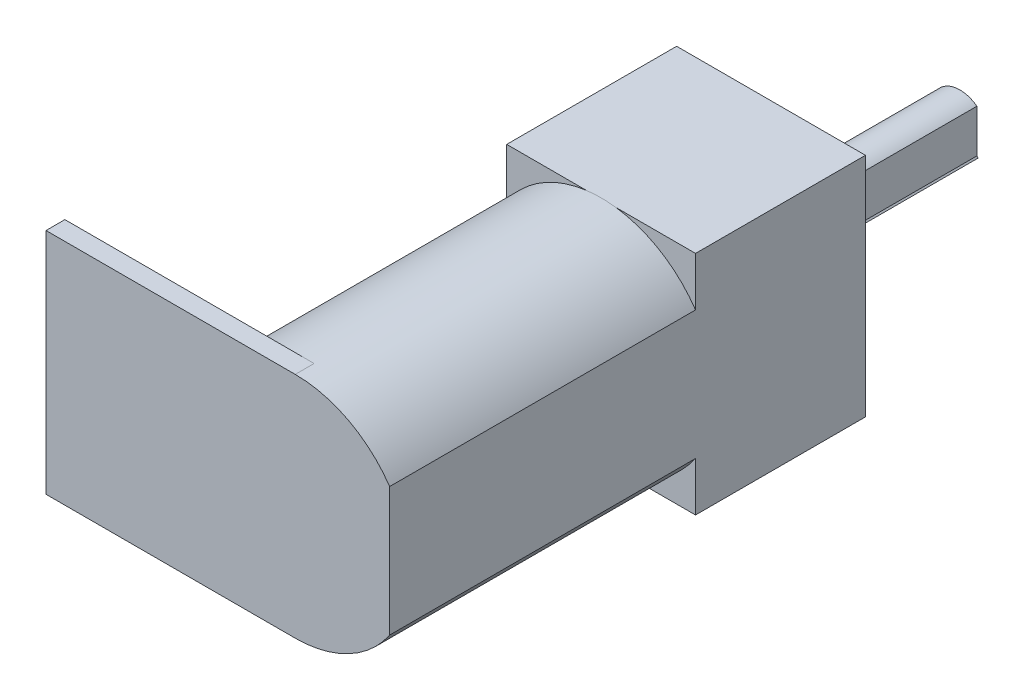
ISO-10303-21;
HEADER;
FILE_DESCRIPTION(('STEP AP214'),'2;1');
FILE_NAME('part.step','',(''),(''),'','','');
FILE_SCHEMA(('AUTOMOTIVE_DESIGN { 1 0 10303 214 1 1 1 1 }'));
ENDSEC;
DATA;
#1=APPLICATION_CONTEXT('core data for automotive mechanical design processes');
#2=APPLICATION_PROTOCOL_DEFINITION('international standard','automotive_design',2000,#1);
#3=PRODUCT_CONTEXT('',#1,'mechanical');
#4=PRODUCT('Part','Part','',(#3));
#5=PRODUCT_RELATED_PRODUCT_CATEGORY('part','',(#4));
#6=PRODUCT_DEFINITION_FORMATION('','',#4);
#7=PRODUCT_DEFINITION_CONTEXT('part definition',#1,'design');
#8=PRODUCT_DEFINITION('design','',#6,#7);
#9=PRODUCT_DEFINITION_SHAPE('','',#8);
#10=(LENGTH_UNIT() NAMED_UNIT(*) SI_UNIT(.MILLI.,.METRE.));
#11=(NAMED_UNIT(*) PLANE_ANGLE_UNIT() SI_UNIT($,.RADIAN.));
#12=(NAMED_UNIT(*) SI_UNIT($,.STERADIAN.) SOLID_ANGLE_UNIT());
#13=UNCERTAINTY_MEASURE_WITH_UNIT(LENGTH_MEASURE(1.E-05),#10,'distance_accuracy_value','');
#14=(GEOMETRIC_REPRESENTATION_CONTEXT(3) GLOBAL_UNCERTAINTY_ASSIGNED_CONTEXT((#13)) GLOBAL_UNIT_ASSIGNED_CONTEXT((#10,
#11,#12)) REPRESENTATION_CONTEXT('',''));
#15=CARTESIAN_POINT('',(0.,0.,0.));
#16=DIRECTION('',(0.,0.,1.));
#17=DIRECTION('',(1.,0.,0.));
#18=AXIS2_PLACEMENT_3D('',#15,#16,#17);
#19=CARTESIAN_POINT('',(0.,0.,0.));
#20=DIRECTION('',(0.,0.,1.));
#21=DIRECTION('',(1.,0.,0.));
#22=AXIS2_PLACEMENT_3D('',#19,#20,#21);
#23=PLANE('',#22);
#24=DIRECTION('',(-1.,0.,0.));
#25=VECTOR('',#24,1.);
#26=CARTESIAN_POINT('',(5.,-6.,0.));
#27=LINE('',#26,#25);
#28=CARTESIAN_POINT('',(0.776208734813005,-6.,0.));
#29=VERTEX_POINT('',#28);
#30=CARTESIAN_POINT('',(-0.776208734813006,-6.,0.));
#31=VERTEX_POINT('',#30);
#32=EDGE_CURVE('E9',#29,#31,#27,.T.);
#33=ORIENTED_EDGE('',*,*,#32,.F.);
#34=CARTESIAN_POINT('',(0.,0.,0.));
#35=DIRECTION('',(0.,0.,1.));
#36=DIRECTION('',(1.,0.,0.));
#37=AXIS2_PLACEMENT_3D('',#34,#35,#36);
#38=CIRCLE('',#37,6.05);
#39=EDGE_CURVE('E313',#31,#29,#38,.T.);
#40=ORIENTED_EDGE('',*,*,#39,.F.);
#41=EDGE_LOOP('',(#33,#40));
#42=FACE_BOUND('',#41,.T.);
#43=ADVANCED_FACE('F15',(#42),#23,.F.);
#44=DIRECTION('',(1.,0.,0.));
#45=VECTOR('',#44,1.);
#46=CARTESIAN_POINT('',(-5.,6.,0.));
#47=LINE('',#46,#45);
#48=CARTESIAN_POINT('',(-0.776208734813017,6.,0.));
#49=VERTEX_POINT('',#48);
#50=CARTESIAN_POINT('',(0.776208734813021,6.,0.));
#51=VERTEX_POINT('',#50);
#52=EDGE_CURVE('E25',#49,#51,#47,.T.);
#53=ORIENTED_EDGE('',*,*,#52,.F.);
#54=CARTESIAN_POINT('',(0.,0.,0.));
#55=DIRECTION('',(0.,0.,1.));
#56=DIRECTION('',(1.,0.,0.));
#57=AXIS2_PLACEMENT_3D('',#54,#55,#56);
#58=CIRCLE('',#57,6.05);
#59=EDGE_CURVE('E296',#51,#49,#58,.T.);
#60=ORIENTED_EDGE('',*,*,#59,.F.);
#61=EDGE_LOOP('',(#53,#60));
#62=FACE_BOUND('',#61,.T.);
#63=ADVANCED_FACE('F349',(#62),#23,.F.);
#64=CARTESIAN_POINT('',(0.,0.,15.2));
#65=DIRECTION('',(0.,0.,-1.));
#66=DIRECTION('',(-1.,0.,0.));
#67=AXIS2_PLACEMENT_3D('',#64,#65,#66);
#68=CYLINDRICAL_SURFACE('',#67,6.05);
#69=CARTESIAN_POINT('',(-5.,-3.40624426605023,0.));
#70=VERTEX_POINT('',#69);
#71=EDGE_CURVE('E19',#70,#31,#38,.T.);
#72=ORIENTED_EDGE('',*,*,#71,.T.);
#73=ORIENTED_EDGE('',*,*,#39,.T.);
#74=CARTESIAN_POINT('',(5.,-3.40624426605022,0.));
#75=VERTEX_POINT('',#74);
#76=EDGE_CURVE('E306',#29,#75,#38,.T.);
#77=ORIENTED_EDGE('',*,*,#76,.T.);
#78=DIRECTION('',(0.,0.,-1.));
#79=VECTOR('',#78,1.);
#80=CARTESIAN_POINT('',(5.,-3.40624426605022,15.2));
#81=LINE('',#80,#79);
#82=CARTESIAN_POINT('',(5.,-3.40624426605022,16.2));
#83=VERTEX_POINT('',#82);
#84=EDGE_CURVE('E303',#83,#75,#81,.T.);
#85=ORIENTED_EDGE('',*,*,#84,.F.);
#86=CARTESIAN_POINT('',(0.,0.,16.2));
#87=DIRECTION('',(0.,0.,1.));
#88=DIRECTION('',(1.,0.,0.));
#89=AXIS2_PLACEMENT_3D('',#86,#87,#88);
#90=CIRCLE('',#89,6.05);
#91=CARTESIAN_POINT('',(0.,-6.05,16.2));
#92=VERTEX_POINT('',#91);
#93=EDGE_CURVE('E175',#92,#83,#90,.T.);
#94=ORIENTED_EDGE('',*,*,#93,.F.);
#95=DIRECTION('',(0.,0.,-1.));
#96=VECTOR('',#95,1.);
#97=CARTESIAN_POINT('',(0.,-6.05,16.2));
#98=LINE('',#97,#96);
#99=CARTESIAN_POINT('',(0.,-6.05,15.2));
#100=VERTEX_POINT('',#99);
#101=EDGE_CURVE('E195',#92,#100,#98,.T.);
#102=ORIENTED_EDGE('',*,*,#101,.T.);
#103=CARTESIAN_POINT('',(0.,0.,15.2));
#104=DIRECTION('',(0.,0.,1.));
#105=DIRECTION('',(1.,0.,0.));
#106=AXIS2_PLACEMENT_3D('',#103,#104,#105);
#107=CIRCLE('',#106,6.05);
#108=CARTESIAN_POINT('',(-5.,-3.40624426605023,15.2));
#109=VERTEX_POINT('',#108);
#110=EDGE_CURVE('E43',#109,#100,#107,.T.);
#111=ORIENTED_EDGE('',*,*,#110,.F.);
#112=DIRECTION('',(0.,0.,-1.));
#113=VECTOR('',#112,1.);
#114=CARTESIAN_POINT('',(-5.,-3.40624426605023,15.2));
#115=LINE('',#114,#113);
#116=EDGE_CURVE('E299',#109,#70,#115,.T.);
#117=ORIENTED_EDGE('',*,*,#116,.T.);
#118=EDGE_LOOP('',(#72,#73,#77,#85,#94,#102,#111,#117));
#119=FACE_BOUND('',#118,.T.);
#120=ADVANCED_FACE('F17',(#119),#68,.T.);
#121=CARTESIAN_POINT('',(5.,-3.40624426605022,15.2));
#122=DIRECTION('',(-1.,0.,0.));
#123=DIRECTION('',(0.,0.,1.));
#124=AXIS2_PLACEMENT_3D('',#121,#122,#123);
#125=PLANE('',#124);
#126=ORIENTED_EDGE('',*,*,#84,.T.);
#127=DIRECTION('',(0.,-1.,0.));
#128=VECTOR('',#127,1.);
#129=CARTESIAN_POINT('',(5.,6.,0.));
#130=LINE('',#129,#128);
#131=CARTESIAN_POINT('',(5.,-6.,0.));
#132=VERTEX_POINT('',#131);
#133=EDGE_CURVE('E260',#75,#132,#130,.T.);
#134=ORIENTED_EDGE('',*,*,#133,.T.);
#135=DIRECTION('',(0.,0.,1.));
#136=VECTOR('',#135,1.);
#137=CARTESIAN_POINT('',(5.,-6.,-9.));
#138=LINE('',#137,#136);
#139=CARTESIAN_POINT('',(5.,-6.,-9.));
#140=VERTEX_POINT('',#139);
#141=EDGE_CURVE('E267',#140,#132,#138,.T.);
#142=ORIENTED_EDGE('',*,*,#141,.F.);
#143=DIRECTION('',(0.,-1.,0.));
#144=VECTOR('',#143,1.);
#145=CARTESIAN_POINT('',(5.,6.,-9.));
#146=LINE('',#145,#144);
#147=CARTESIAN_POINT('',(5.,6.,-9.));
#148=VERTEX_POINT('',#147);
#149=EDGE_CURVE('E244',#148,#140,#146,.T.);
#150=ORIENTED_EDGE('',*,*,#149,.F.);
#151=DIRECTION('',(0.,0.,1.));
#152=VECTOR('',#151,1.);
#153=CARTESIAN_POINT('',(5.,6.,-9.));
#154=LINE('',#153,#152);
#155=CARTESIAN_POINT('',(5.,6.,0.));
#156=VERTEX_POINT('',#155);
#157=EDGE_CURVE('E271',#148,#156,#154,.T.);
#158=ORIENTED_EDGE('',*,*,#157,.T.);
#159=CARTESIAN_POINT('',(5.,3.40624426605022,0.));
#160=VERTEX_POINT('',#159);
#161=EDGE_CURVE('E261',#156,#160,#130,.T.);
#162=ORIENTED_EDGE('',*,*,#161,.T.);
#163=DIRECTION('',(0.,0.,-1.));
#164=VECTOR('',#163,1.);
#165=CARTESIAN_POINT('',(5.,3.40624426605022,15.2));
#166=LINE('',#165,#164);
#167=CARTESIAN_POINT('',(5.,3.40624426605022,16.2));
#168=VERTEX_POINT('',#167);
#169=EDGE_CURVE('E295',#168,#160,#166,.T.);
#170=ORIENTED_EDGE('',*,*,#169,.F.);
#171=DIRECTION('',(0.,1.,0.));
#172=VECTOR('',#171,1.);
#173=CARTESIAN_POINT('',(5.,-3.40624426605022,16.2));
#174=LINE('',#173,#172);
#175=EDGE_CURVE('E183',#83,#168,#174,.T.);
#176=ORIENTED_EDGE('',*,*,#175,.F.);
#177=EDGE_LOOP('',(#126,#134,#142,#150,#158,#162,#170,#176));
#178=FACE_BOUND('',#177,.T.);
#179=ADVANCED_FACE('F341',(#178),#125,.F.);
#180=CARTESIAN_POINT('',(0.,0.,15.2));
#181=DIRECTION('',(0.,0.,-1.));
#182=DIRECTION('',(-1.,0.,0.));
#183=AXIS2_PLACEMENT_3D('',#180,#181,#182);
#184=CYLINDRICAL_SURFACE('',#183,6.05);
#185=EDGE_CURVE('E292',#160,#51,#58,.T.);
#186=ORIENTED_EDGE('',*,*,#185,.T.);
#187=ORIENTED_EDGE('',*,*,#59,.T.);
#188=CARTESIAN_POINT('',(-5.,3.40624426605022,0.));
#189=VERTEX_POINT('',#188);
#190=EDGE_CURVE('E291',#49,#189,#58,.T.);
#191=ORIENTED_EDGE('',*,*,#190,.T.);
#192=DIRECTION('',(0.,0.,-1.));
#193=VECTOR('',#192,1.);
#194=CARTESIAN_POINT('',(-5.,3.40624426605022,15.2));
#195=LINE('',#194,#193);
#196=CARTESIAN_POINT('',(-5.,3.40624426605022,15.2));
#197=VERTEX_POINT('',#196);
#198=EDGE_CURVE('E287',#197,#189,#195,.T.);
#199=ORIENTED_EDGE('',*,*,#198,.F.);
#200=CARTESIAN_POINT('',(0.,0.,15.2));
#201=DIRECTION('',(0.,0.,1.));
#202=DIRECTION('',(1.,0.,0.));
#203=AXIS2_PLACEMENT_3D('',#200,#201,#202);
#204=CIRCLE('',#203,6.05);
#205=CARTESIAN_POINT('',(0.,6.05,15.2));
#206=VERTEX_POINT('',#205);
#207=EDGE_CURVE('E35',#206,#197,#204,.T.);
#208=ORIENTED_EDGE('',*,*,#207,.F.);
#209=DIRECTION('',(0.,0.,-1.));
#210=VECTOR('',#209,1.);
#211=CARTESIAN_POINT('',(0.,6.05,16.2));
#212=LINE('',#211,#210);
#213=CARTESIAN_POINT('',(0.,6.05,16.2));
#214=VERTEX_POINT('',#213);
#215=EDGE_CURVE('E162',#214,#206,#212,.T.);
#216=ORIENTED_EDGE('',*,*,#215,.F.);
#217=CARTESIAN_POINT('',(0.,0.,16.2));
#218=DIRECTION('',(0.,0.,1.));
#219=DIRECTION('',(1.,0.,0.));
#220=AXIS2_PLACEMENT_3D('',#217,#218,#219);
#221=CIRCLE('',#220,6.05);
#222=EDGE_CURVE('E149',#168,#214,#221,.T.);
#223=ORIENTED_EDGE('',*,*,#222,.F.);
#224=ORIENTED_EDGE('',*,*,#169,.T.);
#225=EDGE_LOOP('',(#186,#187,#191,#199,#208,#216,#223,#224));
#226=FACE_BOUND('',#225,.T.);
#227=ADVANCED_FACE('F346',(#226),#184,.T.);
#228=CARTESIAN_POINT('',(-5.,-3.40624426605023,15.2));
#229=DIRECTION('',(1.,0.,0.));
#230=DIRECTION('',(0.,0.,-1.));
#231=AXIS2_PLACEMENT_3D('',#228,#229,#230);
#232=PLANE('',#231);
#233=ORIENTED_EDGE('',*,*,#198,.T.);
#234=DIRECTION('',(0.,1.,0.));
#235=VECTOR('',#234,1.);
#236=CARTESIAN_POINT('',(-5.,-6.,0.));
#237=LINE('',#236,#235);
#238=CARTESIAN_POINT('',(-5.,6.,0.));
#239=VERTEX_POINT('',#238);
#240=EDGE_CURVE('E236',#189,#239,#237,.T.);
#241=ORIENTED_EDGE('',*,*,#240,.T.);
#242=DIRECTION('',(0.,0.,1.));
#243=VECTOR('',#242,1.);
#244=CARTESIAN_POINT('',(-5.,6.,-9.));
#245=LINE('',#244,#243);
#246=CARTESIAN_POINT('',(-5.,6.,-9.));
#247=VERTEX_POINT('',#246);
#248=EDGE_CURVE('E275',#247,#239,#245,.T.);
#249=ORIENTED_EDGE('',*,*,#248,.F.);
#250=DIRECTION('',(0.,1.,0.));
#251=VECTOR('',#250,1.);
#252=CARTESIAN_POINT('',(-5.,-6.,-9.));
#253=LINE('',#252,#251);
#254=CARTESIAN_POINT('',(-5.,-6.,-9.));
#255=VERTEX_POINT('',#254);
#256=EDGE_CURVE('E237',#255,#247,#253,.T.);
#257=ORIENTED_EDGE('',*,*,#256,.F.);
#258=DIRECTION('',(0.,0.,1.));
#259=VECTOR('',#258,1.);
#260=CARTESIAN_POINT('',(-5.,-6.,-9.));
#261=LINE('',#260,#259);
#262=CARTESIAN_POINT('',(-5.,-6.,0.));
#263=VERTEX_POINT('',#262);
#264=EDGE_CURVE('E250',#255,#263,#261,.T.);
#265=ORIENTED_EDGE('',*,*,#264,.T.);
#266=EDGE_CURVE('E251',#263,#70,#237,.T.);
#267=ORIENTED_EDGE('',*,*,#266,.T.);
#268=ORIENTED_EDGE('',*,*,#116,.F.);
#269=DIRECTION('',(0.,-1.,0.));
#270=VECTOR('',#269,1.);
#271=CARTESIAN_POINT('',(-5.,-3.40624426605023,15.2));
#272=LINE('',#271,#270);
#273=EDGE_CURVE('E279',#197,#109,#272,.T.);
#274=ORIENTED_EDGE('',*,*,#273,.F.);
#275=EDGE_LOOP('',(#233,#241,#249,#257,#265,#267,#268,#274));
#276=FACE_BOUND('',#275,.T.);
#277=ADVANCED_FACE('F361',(#276),#232,.F.);
#278=CARTESIAN_POINT('',(0.,0.,0.));
#279=DIRECTION('',(0.,0.,-1.));
#280=DIRECTION('',(-1.,0.,0.));
#281=AXIS2_PLACEMENT_3D('',#278,#279,#280);
#282=PLANE('',#281);
#283=ORIENTED_EDGE('',*,*,#71,.F.);
#284=ORIENTED_EDGE('',*,*,#266,.F.);
#285=EDGE_CURVE('E28',#31,#263,#27,.T.);
#286=ORIENTED_EDGE('',*,*,#285,.F.);
#287=EDGE_LOOP('',(#283,#284,#286));
#288=FACE_BOUND('',#287,.T.);
#289=ADVANCED_FACE('F654',(#288),#282,.F.);
#290=ORIENTED_EDGE('',*,*,#76,.F.);
#291=EDGE_CURVE('E27',#132,#29,#27,.T.);
#292=ORIENTED_EDGE('',*,*,#291,.F.);
#293=ORIENTED_EDGE('',*,*,#133,.F.);
#294=EDGE_LOOP('',(#290,#292,#293));
#295=FACE_BOUND('',#294,.T.);
#296=ADVANCED_FACE('F696',(#295),#282,.F.);
#297=ORIENTED_EDGE('',*,*,#185,.F.);
#298=ORIENTED_EDGE('',*,*,#161,.F.);
#299=EDGE_CURVE('E255',#51,#156,#47,.T.);
#300=ORIENTED_EDGE('',*,*,#299,.F.);
#301=EDGE_LOOP('',(#297,#298,#300));
#302=FACE_BOUND('',#301,.T.);
#303=ADVANCED_FACE('F343',(#302),#282,.F.);
#304=CARTESIAN_POINT('',(-5.,6.,-9.));
#305=DIRECTION('',(0.,-1.,0.));
#306=DIRECTION('',(1.,0.,0.));
#307=AXIS2_PLACEMENT_3D('',#304,#305,#306);
#308=PLANE('',#307);
#309=EDGE_CURVE('E256',#239,#49,#47,.T.);
#310=ORIENTED_EDGE('',*,*,#309,.T.);
#311=ORIENTED_EDGE('',*,*,#52,.T.);
#312=ORIENTED_EDGE('',*,*,#299,.T.);
#313=ORIENTED_EDGE('',*,*,#157,.F.);
#314=DIRECTION('',(1.,0.,0.));
#315=VECTOR('',#314,1.);
#316=CARTESIAN_POINT('',(-5.,6.,-9.));
#317=LINE('',#316,#315);
#318=EDGE_CURVE('E241',#247,#148,#317,.T.);
#319=ORIENTED_EDGE('',*,*,#318,.F.);
#320=ORIENTED_EDGE('',*,*,#248,.T.);
#321=EDGE_LOOP('',(#310,#311,#312,#313,#319,#320));
#322=FACE_BOUND('',#321,.T.);
#323=ADVANCED_FACE('F336',(#322),#308,.F.);
#324=CARTESIAN_POINT('',(5.,-6.,-9.));
#325=DIRECTION('',(0.,1.,0.));
#326=DIRECTION('',(-1.,0.,0.));
#327=AXIS2_PLACEMENT_3D('',#324,#325,#326);
#328=PLANE('',#327);
#329=ORIENTED_EDGE('',*,*,#291,.T.);
#330=ORIENTED_EDGE('',*,*,#32,.T.);
#331=ORIENTED_EDGE('',*,*,#285,.T.);
#332=ORIENTED_EDGE('',*,*,#264,.F.);
#333=DIRECTION('',(-1.,0.,0.));
#334=VECTOR('',#333,1.);
#335=CARTESIAN_POINT('',(5.,-6.,-9.));
#336=LINE('',#335,#334);
#337=EDGE_CURVE('E247',#140,#255,#336,.T.);
#338=ORIENTED_EDGE('',*,*,#337,.F.);
#339=ORIENTED_EDGE('',*,*,#141,.T.);
#340=EDGE_LOOP('',(#329,#330,#331,#332,#338,#339));
#341=FACE_BOUND('',#340,.T.);
#342=ADVANCED_FACE('F664',(#341),#328,.F.);
#343=CARTESIAN_POINT('',(0.,0.,-9.));
#344=DIRECTION('',(0.,0.,-1.));
#345=DIRECTION('',(-1.,0.,0.));
#346=AXIS2_PLACEMENT_3D('',#343,#344,#345);
#347=PLANE('',#346);
#348=DIRECTION('',(0.,-1.,0.));
#349=VECTOR('',#348,1.);
#350=CARTESIAN_POINT('',(0.9,1.2,-9.));
#351=LINE('',#350,#349);
#352=CARTESIAN_POINT('',(0.899999999998557,1.20000000000108,-9.));
#353=VERTEX_POINT('',#352);
#354=CARTESIAN_POINT('',(0.9,-1.08000000000002,-9.));
#355=VERTEX_POINT('',#354);
#356=EDGE_CURVE('E200',#353,#355,#351,.T.);
#357=ORIENTED_EDGE('',*,*,#356,.F.);
#358=CARTESIAN_POINT('',(0.,0.,-9.));
#359=DIRECTION('',(0.,0.,-1.));
#360=DIRECTION('',(0.,1.,0.));
#361=AXIS2_PLACEMENT_3D('',#358,#359,#360);
#362=CIRCLE('',#361,1.5);
#363=CARTESIAN_POINT('',(0.96027659949671,-1.15233191939607,-9.));
#364=VERTEX_POINT('',#363);
#365=EDGE_CURVE('E207',#364,#353,#362,.T.);
#366=ORIENTED_EDGE('',*,*,#365,.F.);
#367=DIRECTION('',(0.640184399664482,-0.768221279597374,0.));
#368=VECTOR('',#367,1.);
#369=CARTESIAN_POINT('',(0.9,-1.08000000000002,-9.));
#370=LINE('',#369,#368);
#371=EDGE_CURVE('E218',#355,#364,#370,.T.);
#372=ORIENTED_EDGE('',*,*,#371,.F.);
#373=EDGE_LOOP('',(#357,#366,#372));
#374=FACE_BOUND('',#373,.T.);
#375=ORIENTED_EDGE('',*,*,#256,.T.);
#376=ORIENTED_EDGE('',*,*,#318,.T.);
#377=ORIENTED_EDGE('',*,*,#149,.T.);
#378=ORIENTED_EDGE('',*,*,#337,.T.);
#379=EDGE_LOOP('',(#375,#376,#377,#378));
#380=FACE_BOUND('',#379,.T.);
#381=ADVANCED_FACE('F652',(#374,#380),#347,.T.);
#382=ORIENTED_EDGE('',*,*,#190,.F.);
#383=ORIENTED_EDGE('',*,*,#309,.F.);
#384=ORIENTED_EDGE('',*,*,#240,.F.);
#385=EDGE_LOOP('',(#382,#383,#384));
#386=FACE_BOUND('',#385,.T.);
#387=ADVANCED_FACE('F363',(#386),#282,.F.);
#388=CARTESIAN_POINT('',(0.9,1.2,-19.));
#389=DIRECTION('',(-1.,0.,0.));
#390=DIRECTION('',(0.,0.,1.));
#391=AXIS2_PLACEMENT_3D('',#388,#389,#390);
#392=PLANE('',#391);
#393=ORIENTED_EDGE('',*,*,#356,.T.);
#394=DIRECTION('',(0.,0.,1.));
#395=VECTOR('',#394,1.);
#396=CARTESIAN_POINT('',(0.9,-1.08000000000002,-19.));
#397=LINE('',#396,#395);
#398=CARTESIAN_POINT('',(0.9,-1.08000000000002,-19.));
#399=VERTEX_POINT('',#398);
#400=EDGE_CURVE('E228',#399,#355,#397,.T.);
#401=ORIENTED_EDGE('',*,*,#400,.F.);
#402=DIRECTION('',(0.,-1.,0.));
#403=VECTOR('',#402,1.);
#404=CARTESIAN_POINT('',(0.9,1.2,-19.));
#405=LINE('',#404,#403);
#406=CARTESIAN_POINT('',(0.899999999998557,1.20000000000108,-19.));
#407=VERTEX_POINT('',#406);
#408=EDGE_CURVE('E206',#407,#399,#405,.T.);
#409=ORIENTED_EDGE('',*,*,#408,.F.);
#410=DIRECTION('',(0.,0.,1.));
#411=VECTOR('',#410,1.);
#412=CARTESIAN_POINT('',(0.899999999998557,1.20000000000108,-19.));
#413=LINE('',#412,#411);
#414=EDGE_CURVE('E232',#407,#353,#413,.T.);
#415=ORIENTED_EDGE('',*,*,#414,.T.);
#416=EDGE_LOOP('',(#393,#401,#409,#415));
#417=FACE_BOUND('',#416,.T.);
#418=ADVANCED_FACE('F629',(#417),#392,.F.);
#419=CARTESIAN_POINT('',(0.9,-1.08000000000002,-19.));
#420=DIRECTION('',(-0.768221279597374,-0.640184399664482,0.));
#421=DIRECTION('',(0.640184399664482,-0.768221279597374,0.));
#422=AXIS2_PLACEMENT_3D('',#419,#420,#421);
#423=PLANE('',#422);
#424=ORIENTED_EDGE('',*,*,#371,.T.);
#425=DIRECTION('',(0.,0.,1.));
#426=VECTOR('',#425,1.);
#427=CARTESIAN_POINT('',(0.96027659949671,-1.15233191939607,-19.));
#428=LINE('',#427,#426);
#429=CARTESIAN_POINT('',(0.96027659949671,-1.15233191939607,-19.));
#430=VERTEX_POINT('',#429);
#431=EDGE_CURVE('E214',#430,#364,#428,.T.);
#432=ORIENTED_EDGE('',*,*,#431,.F.);
#433=DIRECTION('',(0.640184399664482,-0.768221279597374,0.));
#434=VECTOR('',#433,1.);
#435=CARTESIAN_POINT('',(0.9,-1.08000000000002,-19.));
#436=LINE('',#435,#434);
#437=EDGE_CURVE('E210',#399,#430,#436,.T.);
#438=ORIENTED_EDGE('',*,*,#437,.F.);
#439=ORIENTED_EDGE('',*,*,#400,.T.);
#440=EDGE_LOOP('',(#424,#432,#438,#439));
#441=FACE_BOUND('',#440,.T.);
#442=ADVANCED_FACE('F617',(#441),#423,.F.);
#443=CARTESIAN_POINT('',(0.,0.,-19.));
#444=DIRECTION('',(0.,0.,1.));
#445=DIRECTION('',(1.,0.,0.));
#446=AXIS2_PLACEMENT_3D('',#443,#444,#445);
#447=CYLINDRICAL_SURFACE('',#446,1.5);
#448=ORIENTED_EDGE('',*,*,#365,.T.);
#449=ORIENTED_EDGE('',*,*,#414,.F.);
#450=CARTESIAN_POINT('',(0.,0.,-19.));
#451=DIRECTION('',(0.,0.,-1.));
#452=DIRECTION('',(0.,1.,0.));
#453=AXIS2_PLACEMENT_3D('',#450,#451,#452);
#454=CIRCLE('',#453,1.5);
#455=EDGE_CURVE('E202',#430,#407,#454,.T.);
#456=ORIENTED_EDGE('',*,*,#455,.F.);
#457=ORIENTED_EDGE('',*,*,#431,.T.);
#458=EDGE_LOOP('',(#448,#449,#456,#457));
#459=FACE_BOUND('',#458,.T.);
#460=ADVANCED_FACE('F605',(#459),#447,.T.);
#461=CARTESIAN_POINT('',(0.,0.,-19.));
#462=DIRECTION('',(0.,0.,-1.));
#463=DIRECTION('',(-1.,0.,0.));
#464=AXIS2_PLACEMENT_3D('',#461,#462,#463);
#465=PLANE('',#464);
#466=ORIENTED_EDGE('',*,*,#455,.T.);
#467=ORIENTED_EDGE('',*,*,#408,.T.);
#468=ORIENTED_EDGE('',*,*,#437,.T.);
#469=EDGE_LOOP('',(#466,#467,#468));
#470=FACE_BOUND('',#469,.T.);
#471=ADVANCED_FACE('F594',(#470),#465,.T.);
#472=CARTESIAN_POINT('',(0.,0.,15.2));
#473=DIRECTION('',(0.,0.,1.));
#474=DIRECTION('',(1.,0.,0.));
#475=AXIS2_PLACEMENT_3D('',#472,#473,#474);
#476=PLANE('',#475);
#477=ORIENTED_EDGE('',*,*,#273,.T.);
#478=ORIENTED_EDGE('',*,*,#110,.T.);
#479=DIRECTION('',(1.,0.,0.));
#480=VECTOR('',#479,1.);
#481=CARTESIAN_POINT('',(-13.2,-6.05,15.2));
#482=LINE('',#481,#480);
#483=CARTESIAN_POINT('',(-13.2,-6.05,15.2));
#484=VERTEX_POINT('',#483);
#485=EDGE_CURVE('E177',#484,#100,#482,.T.);
#486=ORIENTED_EDGE('',*,*,#485,.F.);
#487=DIRECTION('',(0.,-1.,0.));
#488=VECTOR('',#487,1.);
#489=CARTESIAN_POINT('',(-13.2,6.05,15.2));
#490=LINE('',#489,#488);
#491=CARTESIAN_POINT('',(-13.2,6.05,15.2));
#492=VERTEX_POINT('',#491);
#493=EDGE_CURVE('E188',#492,#484,#490,.T.);
#494=ORIENTED_EDGE('',*,*,#493,.F.);
#495=DIRECTION('',(-1.,0.,0.));
#496=VECTOR('',#495,1.);
#497=CARTESIAN_POINT('',(0.,6.05,15.2));
#498=LINE('',#497,#496);
#499=EDGE_CURVE('E157',#206,#492,#498,.T.);
#500=ORIENTED_EDGE('',*,*,#499,.F.);
#501=ORIENTED_EDGE('',*,*,#207,.T.);
#502=EDGE_LOOP('',(#477,#478,#486,#494,#500,#501));
#503=FACE_BOUND('',#502,.T.);
#504=ADVANCED_FACE('F583',(#503),#476,.F.);
#505=CARTESIAN_POINT('',(-13.2,6.05,16.2));
#506=DIRECTION('',(1.,0.,0.));
#507=DIRECTION('',(0.,1.,0.));
#508=AXIS2_PLACEMENT_3D('',#505,#506,#507);
#509=PLANE('',#508);
#510=ORIENTED_EDGE('',*,*,#493,.T.);
#511=DIRECTION('',(0.,0.,-1.));
#512=VECTOR('',#511,1.);
#513=CARTESIAN_POINT('',(-13.2,-6.05,16.2));
#514=LINE('',#513,#512);
#515=CARTESIAN_POINT('',(-13.2,-6.05,16.2));
#516=VERTEX_POINT('',#515);
#517=EDGE_CURVE('E166',#516,#484,#514,.T.);
#518=ORIENTED_EDGE('',*,*,#517,.F.);
#519=DIRECTION('',(0.,-1.,0.));
#520=VECTOR('',#519,1.);
#521=CARTESIAN_POINT('',(-13.2,6.05,16.2));
#522=LINE('',#521,#520);
#523=CARTESIAN_POINT('',(-13.2,6.05,16.2));
#524=VERTEX_POINT('',#523);
#525=EDGE_CURVE('E145',#524,#516,#522,.T.);
#526=ORIENTED_EDGE('',*,*,#525,.F.);
#527=DIRECTION('',(0.,0.,-1.));
#528=VECTOR('',#527,1.);
#529=CARTESIAN_POINT('',(-13.2,6.05,16.2));
#530=LINE('',#529,#528);
#531=EDGE_CURVE('E152',#524,#492,#530,.T.);
#532=ORIENTED_EDGE('',*,*,#531,.T.);
#533=EDGE_LOOP('',(#510,#518,#526,#532));
#534=FACE_BOUND('',#533,.T.);
#535=ADVANCED_FACE('F164',(#534),#509,.F.);
#536=CARTESIAN_POINT('',(-13.2,-6.05,16.2));
#537=DIRECTION('',(0.,1.,0.));
#538=DIRECTION('',(-1.,0.,0.));
#539=AXIS2_PLACEMENT_3D('',#536,#537,#538);
#540=PLANE('',#539);
#541=ORIENTED_EDGE('',*,*,#485,.T.);
#542=ORIENTED_EDGE('',*,*,#101,.F.);
#543=DIRECTION('',(1.,0.,0.));
#544=VECTOR('',#543,1.);
#545=CARTESIAN_POINT('',(-13.2,-6.05,16.2));
#546=LINE('',#545,#544);
#547=EDGE_CURVE('E168',#516,#92,#546,.T.);
#548=ORIENTED_EDGE('',*,*,#547,.F.);
#549=ORIENTED_EDGE('',*,*,#517,.T.);
#550=EDGE_LOOP('',(#541,#542,#548,#549));
#551=FACE_BOUND('',#550,.T.);
#552=ADVANCED_FACE('F561',(#551),#540,.F.);
#553=CARTESIAN_POINT('',(0.,6.05,16.2));
#554=DIRECTION('',(0.,-1.,0.));
#555=DIRECTION('',(1.,0.,0.));
#556=AXIS2_PLACEMENT_3D('',#553,#554,#555);
#557=PLANE('',#556);
#558=ORIENTED_EDGE('',*,*,#499,.T.);
#559=ORIENTED_EDGE('',*,*,#531,.F.);
#560=DIRECTION('',(-1.,0.,0.));
#561=VECTOR('',#560,1.);
#562=CARTESIAN_POINT('',(0.,6.05,16.2));
#563=LINE('',#562,#561);
#564=EDGE_CURVE('E141',#214,#524,#563,.T.);
#565=ORIENTED_EDGE('',*,*,#564,.F.);
#566=ORIENTED_EDGE('',*,*,#215,.T.);
#567=EDGE_LOOP('',(#558,#559,#565,#566));
#568=FACE_BOUND('',#567,.T.);
#569=ADVANCED_FACE('F155',(#568),#557,.F.);
#570=CARTESIAN_POINT('',(0.,0.,16.2));
#571=DIRECTION('',(0.,0.,1.));
#572=DIRECTION('',(1.,0.,0.));
#573=AXIS2_PLACEMENT_3D('',#570,#571,#572);
#574=PLANE('',#573);
#575=ORIENTED_EDGE('',*,*,#525,.T.);
#576=ORIENTED_EDGE('',*,*,#547,.T.);
#577=ORIENTED_EDGE('',*,*,#93,.T.);
#578=ORIENTED_EDGE('',*,*,#175,.T.);
#579=ORIENTED_EDGE('',*,*,#222,.T.);
#580=ORIENTED_EDGE('',*,*,#564,.T.);
#581=EDGE_LOOP('',(#575,#576,#577,#578,#579,#580));
#582=FACE_BOUND('',#581,.T.);
#583=ADVANCED_FACE('F143',(#582),#574,.T.);
#584=CLOSED_SHELL('',(#43,#63,#120,#179,#227,#277,#289,#296,#303,#323,#342,#381,#387,#418,#442,
#460,#471,#504,#535,#552,#569,#583));
#585=MANIFOLD_SOLID_BREP('B1',#584);
#586=ADVANCED_BREP_SHAPE_REPRESENTATION('',(#18,#585),#14);
#587=SHAPE_DEFINITION_REPRESENTATION(#9,#586);
ENDSEC;
END-ISO-10303-21;
